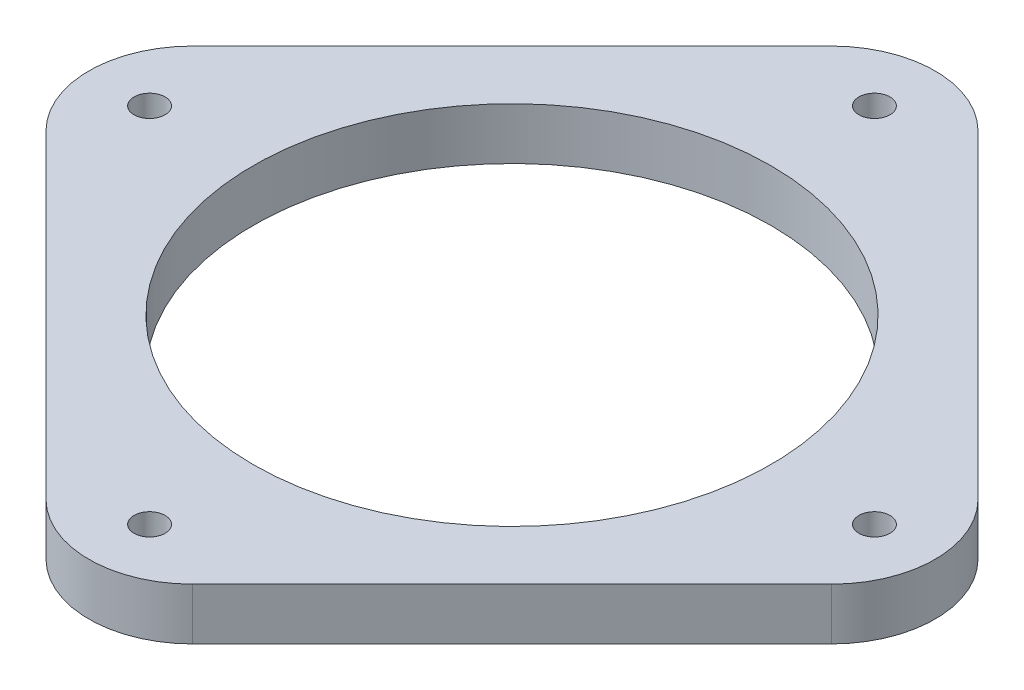
ISO-10303-21;
HEADER;
FILE_DESCRIPTION(('STEP AP214'),'2;1');
FILE_NAME('part.step','',(''),(''),'','','');
FILE_SCHEMA(('AUTOMOTIVE_DESIGN { 1 0 10303 214 1 1 1 1 }'));
ENDSEC;
DATA;
#1=APPLICATION_CONTEXT('core data for automotive mechanical design processes');
#2=APPLICATION_PROTOCOL_DEFINITION('international standard','automotive_design',2000,#1);
#3=PRODUCT_CONTEXT('',#1,'mechanical');
#4=PRODUCT('Part','Part','',(#3));
#5=PRODUCT_RELATED_PRODUCT_CATEGORY('part','',(#4));
#6=PRODUCT_DEFINITION_FORMATION('','',#4);
#7=PRODUCT_DEFINITION_CONTEXT('part definition',#1,'design');
#8=PRODUCT_DEFINITION('design','',#6,#7);
#9=PRODUCT_DEFINITION_SHAPE('','',#8);
#10=(LENGTH_UNIT() NAMED_UNIT(*) SI_UNIT(.MILLI.,.METRE.));
#11=(NAMED_UNIT(*) PLANE_ANGLE_UNIT() SI_UNIT($,.RADIAN.));
#12=(NAMED_UNIT(*) SI_UNIT($,.STERADIAN.) SOLID_ANGLE_UNIT());
#13=UNCERTAINTY_MEASURE_WITH_UNIT(LENGTH_MEASURE(1.E-05),#10,'distance_accuracy_value','');
#14=(GEOMETRIC_REPRESENTATION_CONTEXT(3) GLOBAL_UNCERTAINTY_ASSIGNED_CONTEXT((#13)) GLOBAL_UNIT_ASSIGNED_CONTEXT((#10,
#11,#12)) REPRESENTATION_CONTEXT('',''));
#15=CARTESIAN_POINT('',(0.,0.,0.));
#16=DIRECTION('',(0.,0.,1.));
#17=DIRECTION('',(1.,0.,0.));
#18=AXIS2_PLACEMENT_3D('',#15,#16,#17);
#19=CARTESIAN_POINT('',(0.,5.,30.8578643762691));
#20=DIRECTION('',(0.,1.,0.));
#21=DIRECTION('',(0.,0.,1.));
#22=AXIS2_PLACEMENT_3D('',#19,#20,#21);
#23=PLANE('',#22);
#24=CARTESIAN_POINT('',(-35.,5.,-2.44403693719019E-13));
#25=DIRECTION('',(0.,1.,0.));
#26=DIRECTION('',(0.,0.,1.));
#27=AXIS2_PLACEMENT_3D('',#24,#25,#26);
#28=CIRCLE('',#27,1.5);
#29=CARTESIAN_POINT('',(-35.,5.,1.49999999999976));
#30=VERTEX_POINT('',#29);
#31=EDGE_CURVE('E200',#30,#30,#28,.T.);
#32=ORIENTED_EDGE('',*,*,#31,.F.);
#33=EDGE_LOOP('',(#32));
#34=FACE_BOUND('',#33,.T.);
#35=CARTESIAN_POINT('',(35.,5.,0.));
#36=DIRECTION('',(0.,1.,0.));
#37=DIRECTION('',(0.,0.,1.));
#38=AXIS2_PLACEMENT_3D('',#35,#36,#37);
#39=CIRCLE('',#38,1.5);
#40=CARTESIAN_POINT('',(35.,5.,1.5));
#41=VERTEX_POINT('',#40);
#42=EDGE_CURVE('E188',#41,#41,#39,.T.);
#43=ORIENTED_EDGE('',*,*,#42,.F.);
#44=EDGE_LOOP('',(#43));
#45=FACE_BOUND('',#44,.T.);
#46=CARTESIAN_POINT('',(0.,5.,30.8578643762691));
#47=DIRECTION('',(0.,1.,0.));
#48=DIRECTION('',(0.,0.,1.));
#49=AXIS2_PLACEMENT_3D('',#46,#47,#48);
#50=CIRCLE('',#49,10.);
#51=CARTESIAN_POINT('',(-7.07106781186553,5.,37.9289321881345));
#52=VERTEX_POINT('',#51);
#53=CARTESIAN_POINT('',(7.07106781186552,5.,37.9289321881345));
#54=VERTEX_POINT('',#53);
#55=EDGE_CURVE('E151',#52,#54,#50,.T.);
#56=ORIENTED_EDGE('',*,*,#55,.T.);
#57=DIRECTION('',(0.707106781186548,0.,-0.707106781186547));
#58=VECTOR('',#57,1.);
#59=CARTESIAN_POINT('',(7.07106781186552,5.,37.9289321881345));
#60=LINE('',#59,#58);
#61=CARTESIAN_POINT('',(37.9289321881345,5.,7.07106781186553));
#62=VERTEX_POINT('',#61);
#63=EDGE_CURVE('E99',#54,#62,#60,.T.);
#64=ORIENTED_EDGE('',*,*,#63,.T.);
#65=CARTESIAN_POINT('',(30.8578643762691,5.,0.));
#66=DIRECTION('',(0.,1.,0.));
#67=DIRECTION('',(0.,0.,1.));
#68=AXIS2_PLACEMENT_3D('',#65,#66,#67);
#69=CIRCLE('',#68,10.);
#70=CARTESIAN_POINT('',(37.9289321881345,5.,-7.07106781186553));
#71=VERTEX_POINT('',#70);
#72=EDGE_CURVE('E166',#62,#71,#69,.T.);
#73=ORIENTED_EDGE('',*,*,#72,.T.);
#74=DIRECTION('',(-0.707106781186548,0.,-0.707106781186548));
#75=VECTOR('',#74,1.);
#76=CARTESIAN_POINT('',(37.9289321881345,5.,-7.07106781186553));
#77=LINE('',#76,#75);
#78=CARTESIAN_POINT('',(7.07106781186552,5.,-37.9289321881345));
#79=VERTEX_POINT('',#78);
#80=EDGE_CURVE('E179',#71,#79,#77,.T.);
#81=ORIENTED_EDGE('',*,*,#80,.T.);
#82=CARTESIAN_POINT('',(0.,5.,-30.8578643762691));
#83=DIRECTION('',(0.,1.,0.));
#84=DIRECTION('',(0.,0.,1.));
#85=AXIS2_PLACEMENT_3D('',#82,#83,#84);
#86=CIRCLE('',#85,10.);
#87=CARTESIAN_POINT('',(-7.07106781186553,5.,-37.9289321881345));
#88=VERTEX_POINT('',#87);
#89=EDGE_CURVE('E118',#79,#88,#86,.T.);
#90=ORIENTED_EDGE('',*,*,#89,.T.);
#91=DIRECTION('',(-0.707106781186547,0.,0.707106781186548));
#92=VECTOR('',#91,1.);
#93=CARTESIAN_POINT('',(-7.07106781186553,5.,-37.9289321881345));
#94=LINE('',#93,#92);
#95=CARTESIAN_POINT('',(-37.9289321881345,5.,-7.07106781186552));
#96=VERTEX_POINT('',#95);
#97=EDGE_CURVE('E112',#88,#96,#94,.T.);
#98=ORIENTED_EDGE('',*,*,#97,.T.);
#99=CARTESIAN_POINT('',(-30.857864376269,5.,0.));
#100=DIRECTION('',(0.,1.,0.));
#101=DIRECTION('',(0.,0.,-1.));
#102=AXIS2_PLACEMENT_3D('',#99,#100,#101);
#103=CIRCLE('',#102,10.);
#104=CARTESIAN_POINT('',(-37.9289321881345,5.,7.07106781186553));
#105=VERTEX_POINT('',#104);
#106=EDGE_CURVE('E116',#96,#105,#103,.T.);
#107=ORIENTED_EDGE('',*,*,#106,.T.);
#108=DIRECTION('',(0.707106781186547,0.,0.707106781186548));
#109=VECTOR('',#108,1.);
#110=CARTESIAN_POINT('',(-37.9289321881345,5.,7.07106781186553));
#111=LINE('',#110,#109);
#112=EDGE_CURVE('E56',#105,#52,#111,.T.);
#113=ORIENTED_EDGE('',*,*,#112,.T.);
#114=EDGE_LOOP('',(#56,#64,#73,#81,#90,#98,#107,#113));
#115=FACE_BOUND('',#114,.T.);
#116=CARTESIAN_POINT('',(0.,5.,0.));
#117=DIRECTION('',(0.,1.,0.));
#118=DIRECTION('',(0.,0.,1.));
#119=AXIS2_PLACEMENT_3D('',#116,#117,#118);
#120=CIRCLE('',#119,25.);
#121=CARTESIAN_POINT('',(0.,5.,25.));
#122=VERTEX_POINT('',#121);
#123=EDGE_CURVE('E140',#122,#122,#120,.T.);
#124=ORIENTED_EDGE('',*,*,#123,.F.);
#125=EDGE_LOOP('',(#124));
#126=FACE_BOUND('',#125,.T.);
#127=CARTESIAN_POINT('',(-1.2220184685951E-13,5.,35.));
#128=DIRECTION('',(0.,1.,0.));
#129=DIRECTION('',(0.,0.,1.));
#130=AXIS2_PLACEMENT_3D('',#127,#128,#129);
#131=CIRCLE('',#130,1.5);
#132=CARTESIAN_POINT('',(-1.2220184685951E-13,5.,36.5));
#133=VERTEX_POINT('',#132);
#134=EDGE_CURVE('E194',#133,#133,#131,.T.);
#135=ORIENTED_EDGE('',*,*,#134,.F.);
#136=EDGE_LOOP('',(#135));
#137=FACE_BOUND('',#136,.T.);
#138=CARTESIAN_POINT('',(3.66605540578529E-13,5.,-35.));
#139=DIRECTION('',(0.,1.,0.));
#140=DIRECTION('',(0.,0.,1.));
#141=AXIS2_PLACEMENT_3D('',#138,#139,#140);
#142=CIRCLE('',#141,1.50000000000001);
#143=CARTESIAN_POINT('',(3.66605540578529E-13,5.,-33.5));
#144=VERTEX_POINT('',#143);
#145=EDGE_CURVE('E206',#144,#144,#142,.T.);
#146=ORIENTED_EDGE('',*,*,#145,.F.);
#147=EDGE_LOOP('',(#146));
#148=FACE_BOUND('',#147,.T.);
#149=ADVANCED_FACE('F39',(#34,#45,#115,#126,#137,#148),#23,.T.);
#150=CARTESIAN_POINT('',(0.,0.,30.8578643762691));
#151=DIRECTION('',(0.,1.,0.));
#152=DIRECTION('',(0.,0.,1.));
#153=AXIS2_PLACEMENT_3D('',#150,#151,#152);
#154=PLANE('',#153);
#155=CARTESIAN_POINT('',(0.,0.,30.8578643762691));
#156=DIRECTION('',(0.,1.,0.));
#157=DIRECTION('',(0.,0.,1.));
#158=AXIS2_PLACEMENT_3D('',#155,#156,#157);
#159=CIRCLE('',#158,10.);
#160=CARTESIAN_POINT('',(-7.07106781186553,0.,37.9289321881345));
#161=VERTEX_POINT('',#160);
#162=CARTESIAN_POINT('',(7.07106781186552,0.,37.9289321881345));
#163=VERTEX_POINT('',#162);
#164=EDGE_CURVE('E136',#161,#163,#159,.T.);
#165=ORIENTED_EDGE('',*,*,#164,.F.);
#166=DIRECTION('',(0.707106781186547,0.,0.707106781186548));
#167=VECTOR('',#166,1.);
#168=CARTESIAN_POINT('',(-37.9289321881345,0.,7.07106781186553));
#169=LINE('',#168,#167);
#170=CARTESIAN_POINT('',(-37.9289321881345,0.,7.07106781186553));
#171=VERTEX_POINT('',#170);
#172=EDGE_CURVE('E91',#171,#161,#169,.T.);
#173=ORIENTED_EDGE('',*,*,#172,.F.);
#174=CARTESIAN_POINT('',(-30.857864376269,0.,0.));
#175=DIRECTION('',(0.,1.,0.));
#176=DIRECTION('',(0.,0.,-1.));
#177=AXIS2_PLACEMENT_3D('',#174,#175,#176);
#178=CIRCLE('',#177,10.);
#179=CARTESIAN_POINT('',(-37.9289321881345,0.,-7.07106781186552));
#180=VERTEX_POINT('',#179);
#181=EDGE_CURVE('E85',#180,#171,#178,.T.);
#182=ORIENTED_EDGE('',*,*,#181,.F.);
#183=DIRECTION('',(-0.707106781186547,0.,0.707106781186548));
#184=VECTOR('',#183,1.);
#185=CARTESIAN_POINT('',(-7.07106781186553,0.,-37.9289321881345));
#186=LINE('',#185,#184);
#187=CARTESIAN_POINT('',(-7.07106781186553,0.,-37.9289321881345));
#188=VERTEX_POINT('',#187);
#189=EDGE_CURVE('E126',#188,#180,#186,.T.);
#190=ORIENTED_EDGE('',*,*,#189,.F.);
#191=CARTESIAN_POINT('',(0.,0.,-30.8578643762691));
#192=DIRECTION('',(0.,1.,0.));
#193=DIRECTION('',(0.,0.,1.));
#194=AXIS2_PLACEMENT_3D('',#191,#192,#193);
#195=CIRCLE('',#194,10.);
#196=CARTESIAN_POINT('',(7.07106781186552,0.,-37.9289321881345));
#197=VERTEX_POINT('',#196);
#198=EDGE_CURVE('E146',#197,#188,#195,.T.);
#199=ORIENTED_EDGE('',*,*,#198,.F.);
#200=DIRECTION('',(-0.707106781186548,0.,-0.707106781186548));
#201=VECTOR('',#200,1.);
#202=CARTESIAN_POINT('',(37.9289321881345,0.,-7.07106781186553));
#203=LINE('',#202,#201);
#204=CARTESIAN_POINT('',(37.9289321881345,0.,-7.07106781186553));
#205=VERTEX_POINT('',#204);
#206=EDGE_CURVE('E144',#205,#197,#203,.T.);
#207=ORIENTED_EDGE('',*,*,#206,.F.);
#208=CARTESIAN_POINT('',(30.8578643762691,0.,0.));
#209=DIRECTION('',(0.,1.,0.));
#210=DIRECTION('',(0.,0.,1.));
#211=AXIS2_PLACEMENT_3D('',#208,#209,#210);
#212=CIRCLE('',#211,10.);
#213=CARTESIAN_POINT('',(37.9289321881345,0.,7.07106781186553));
#214=VERTEX_POINT('',#213);
#215=EDGE_CURVE('E142',#214,#205,#212,.T.);
#216=ORIENTED_EDGE('',*,*,#215,.F.);
#217=DIRECTION('',(0.707106781186548,0.,-0.707106781186547));
#218=VECTOR('',#217,1.);
#219=CARTESIAN_POINT('',(7.07106781186552,0.,37.9289321881345));
#220=LINE('',#219,#218);
#221=EDGE_CURVE('E139',#163,#214,#220,.T.);
#222=ORIENTED_EDGE('',*,*,#221,.F.);
#223=EDGE_LOOP('',(#165,#173,#182,#190,#199,#207,#216,#222));
#224=FACE_BOUND('',#223,.T.);
#225=CARTESIAN_POINT('',(0.,0.,0.));
#226=DIRECTION('',(0.,1.,0.));
#227=DIRECTION('',(0.,0.,1.));
#228=AXIS2_PLACEMENT_3D('',#225,#226,#227);
#229=CIRCLE('',#228,25.);
#230=CARTESIAN_POINT('',(0.,0.,25.));
#231=VERTEX_POINT('',#230);
#232=EDGE_CURVE('E185',#231,#231,#229,.T.);
#233=ORIENTED_EDGE('',*,*,#232,.T.);
#234=EDGE_LOOP('',(#233));
#235=FACE_BOUND('',#234,.T.);
#236=CARTESIAN_POINT('',(35.,0.,0.));
#237=DIRECTION('',(0.,1.,0.));
#238=DIRECTION('',(0.,0.,1.));
#239=AXIS2_PLACEMENT_3D('',#236,#237,#238);
#240=CIRCLE('',#239,1.5);
#241=CARTESIAN_POINT('',(35.,0.,1.5));
#242=VERTEX_POINT('',#241);
#243=EDGE_CURVE('E191',#242,#242,#240,.T.);
#244=ORIENTED_EDGE('',*,*,#243,.T.);
#245=EDGE_LOOP('',(#244));
#246=FACE_BOUND('',#245,.T.);
#247=CARTESIAN_POINT('',(-1.2220184685951E-13,0.,35.));
#248=DIRECTION('',(0.,1.,0.));
#249=DIRECTION('',(0.,0.,1.));
#250=AXIS2_PLACEMENT_3D('',#247,#248,#249);
#251=CIRCLE('',#250,1.5);
#252=CARTESIAN_POINT('',(-1.2220184685951E-13,0.,36.5));
#253=VERTEX_POINT('',#252);
#254=EDGE_CURVE('E197',#253,#253,#251,.T.);
#255=ORIENTED_EDGE('',*,*,#254,.T.);
#256=EDGE_LOOP('',(#255));
#257=FACE_BOUND('',#256,.T.);
#258=CARTESIAN_POINT('',(-35.,0.,-2.44403693719019E-13));
#259=DIRECTION('',(0.,1.,0.));
#260=DIRECTION('',(0.,0.,1.));
#261=AXIS2_PLACEMENT_3D('',#258,#259,#260);
#262=CIRCLE('',#261,1.5);
#263=CARTESIAN_POINT('',(-35.,0.,1.49999999999976));
#264=VERTEX_POINT('',#263);
#265=EDGE_CURVE('E203',#264,#264,#262,.T.);
#266=ORIENTED_EDGE('',*,*,#265,.T.);
#267=EDGE_LOOP('',(#266));
#268=FACE_BOUND('',#267,.T.);
#269=CARTESIAN_POINT('',(3.66605540578529E-13,0.,-35.));
#270=DIRECTION('',(0.,1.,0.));
#271=DIRECTION('',(0.,0.,1.));
#272=AXIS2_PLACEMENT_3D('',#269,#270,#271);
#273=CIRCLE('',#272,1.50000000000001);
#274=CARTESIAN_POINT('',(3.66605540578529E-13,0.,-33.5));
#275=VERTEX_POINT('',#274);
#276=EDGE_CURVE('E209',#275,#275,#273,.T.);
#277=ORIENTED_EDGE('',*,*,#276,.T.);
#278=EDGE_LOOP('',(#277));
#279=FACE_BOUND('',#278,.T.);
#280=ADVANCED_FACE('F170',(#224,#235,#246,#257,#268,#279),#154,.F.);
#281=CARTESIAN_POINT('',(0.,5.,30.8578643762691));
#282=DIRECTION('',(0.,-1.,0.));
#283=DIRECTION('',(0.,0.,-1.));
#284=AXIS2_PLACEMENT_3D('',#281,#282,#283);
#285=CYLINDRICAL_SURFACE('',#284,10.);
#286=ORIENTED_EDGE('',*,*,#164,.T.);
#287=DIRECTION('',(0.,-1.,0.));
#288=VECTOR('',#287,1.);
#289=CARTESIAN_POINT('',(7.07106781186552,5.,37.9289321881345));
#290=LINE('',#289,#288);
#291=EDGE_CURVE('E11',#54,#163,#290,.T.);
#292=ORIENTED_EDGE('',*,*,#291,.F.);
#293=ORIENTED_EDGE('',*,*,#55,.F.);
#294=DIRECTION('',(0.,-1.,0.));
#295=VECTOR('',#294,1.);
#296=CARTESIAN_POINT('',(-7.07106781186553,5.,37.9289321881345));
#297=LINE('',#296,#295);
#298=EDGE_CURVE('E132',#52,#161,#297,.T.);
#299=ORIENTED_EDGE('',*,*,#298,.T.);
#300=EDGE_LOOP('',(#286,#292,#293,#299));
#301=FACE_BOUND('',#300,.T.);
#302=ADVANCED_FACE('F41',(#301),#285,.T.);
#303=CARTESIAN_POINT('',(7.07106781186552,5.,37.9289321881345));
#304=DIRECTION('',(-0.707106781186547,0.,-0.707106781186548));
#305=DIRECTION('',(-0.707106781186548,0.,0.707106781186547));
#306=AXIS2_PLACEMENT_3D('',#303,#304,#305);
#307=PLANE('',#306);
#308=ORIENTED_EDGE('',*,*,#221,.T.);
#309=DIRECTION('',(0.,-1.,0.));
#310=VECTOR('',#309,1.);
#311=CARTESIAN_POINT('',(37.9289321881345,5.,7.07106781186553));
#312=LINE('',#311,#310);
#313=EDGE_CURVE('E48',#62,#214,#312,.T.);
#314=ORIENTED_EDGE('',*,*,#313,.F.);
#315=ORIENTED_EDGE('',*,*,#63,.F.);
#316=ORIENTED_EDGE('',*,*,#291,.T.);
#317=EDGE_LOOP('',(#308,#314,#315,#316));
#318=FACE_BOUND('',#317,.T.);
#319=ADVANCED_FACE('F243',(#318),#307,.F.);
#320=CARTESIAN_POINT('',(30.8578643762691,5.,0.));
#321=DIRECTION('',(0.,-1.,0.));
#322=DIRECTION('',(0.,0.,-1.));
#323=AXIS2_PLACEMENT_3D('',#320,#321,#322);
#324=CYLINDRICAL_SURFACE('',#323,10.);
#325=ORIENTED_EDGE('',*,*,#215,.T.);
#326=DIRECTION('',(0.,-1.,0.));
#327=VECTOR('',#326,1.);
#328=CARTESIAN_POINT('',(37.9289321881345,5.,-7.07106781186553));
#329=LINE('',#328,#327);
#330=EDGE_CURVE('E158',#71,#205,#329,.T.);
#331=ORIENTED_EDGE('',*,*,#330,.F.);
#332=ORIENTED_EDGE('',*,*,#72,.F.);
#333=ORIENTED_EDGE('',*,*,#313,.T.);
#334=EDGE_LOOP('',(#325,#331,#332,#333));
#335=FACE_BOUND('',#334,.T.);
#336=ADVANCED_FACE('F164',(#335),#324,.T.);
#337=CARTESIAN_POINT('',(37.9289321881345,5.,-7.07106781186553));
#338=DIRECTION('',(-0.707106781186548,0.,0.707106781186548));
#339=DIRECTION('',(0.707106781186548,0.,0.707106781186548));
#340=AXIS2_PLACEMENT_3D('',#337,#338,#339);
#341=PLANE('',#340);
#342=ORIENTED_EDGE('',*,*,#206,.T.);
#343=DIRECTION('',(0.,-1.,0.));
#344=VECTOR('',#343,1.);
#345=CARTESIAN_POINT('',(7.07106781186552,5.,-37.9289321881345));
#346=LINE('',#345,#344);
#347=EDGE_CURVE('E155',#79,#197,#346,.T.);
#348=ORIENTED_EDGE('',*,*,#347,.F.);
#349=ORIENTED_EDGE('',*,*,#80,.F.);
#350=ORIENTED_EDGE('',*,*,#330,.T.);
#351=EDGE_LOOP('',(#342,#348,#349,#350));
#352=FACE_BOUND('',#351,.T.);
#353=ADVANCED_FACE('F175',(#352),#341,.F.);
#354=CARTESIAN_POINT('',(0.,5.,-30.8578643762691));
#355=DIRECTION('',(0.,-1.,0.));
#356=DIRECTION('',(0.,0.,-1.));
#357=AXIS2_PLACEMENT_3D('',#354,#355,#356);
#358=CYLINDRICAL_SURFACE('',#357,10.);
#359=ORIENTED_EDGE('',*,*,#198,.T.);
#360=DIRECTION('',(0.,-1.,0.));
#361=VECTOR('',#360,1.);
#362=CARTESIAN_POINT('',(-7.07106781186553,5.,-37.9289321881345));
#363=LINE('',#362,#361);
#364=EDGE_CURVE('E127',#88,#188,#363,.T.);
#365=ORIENTED_EDGE('',*,*,#364,.F.);
#366=ORIENTED_EDGE('',*,*,#89,.F.);
#367=ORIENTED_EDGE('',*,*,#347,.T.);
#368=EDGE_LOOP('',(#359,#365,#366,#367));
#369=FACE_BOUND('',#368,.T.);
#370=ADVANCED_FACE('F178',(#369),#358,.T.);
#371=CARTESIAN_POINT('',(-7.07106781186553,5.,-37.9289321881345));
#372=DIRECTION('',(0.707106781186548,0.,0.707106781186547));
#373=DIRECTION('',(0.707106781186547,0.,-0.707106781186548));
#374=AXIS2_PLACEMENT_3D('',#371,#372,#373);
#375=PLANE('',#374);
#376=ORIENTED_EDGE('',*,*,#189,.T.);
#377=DIRECTION('',(0.,-1.,0.));
#378=VECTOR('',#377,1.);
#379=CARTESIAN_POINT('',(-37.9289321881345,5.,-7.07106781186552));
#380=LINE('',#379,#378);
#381=EDGE_CURVE('E123',#96,#180,#380,.T.);
#382=ORIENTED_EDGE('',*,*,#381,.F.);
#383=ORIENTED_EDGE('',*,*,#97,.F.);
#384=ORIENTED_EDGE('',*,*,#364,.T.);
#385=EDGE_LOOP('',(#376,#382,#383,#384));
#386=FACE_BOUND('',#385,.T.);
#387=ADVANCED_FACE('F124',(#386),#375,.F.);
#388=CARTESIAN_POINT('',(-30.857864376269,5.,0.));
#389=DIRECTION('',(0.,-1.,0.));
#390=DIRECTION('',(0.,0.,-1.));
#391=AXIS2_PLACEMENT_3D('',#388,#389,#390);
#392=CYLINDRICAL_SURFACE('',#391,10.);
#393=ORIENTED_EDGE('',*,*,#181,.T.);
#394=DIRECTION('',(0.,-1.,0.));
#395=VECTOR('',#394,1.);
#396=CARTESIAN_POINT('',(-37.9289321881345,5.,7.07106781186553));
#397=LINE('',#396,#395);
#398=EDGE_CURVE('E128',#105,#171,#397,.T.);
#399=ORIENTED_EDGE('',*,*,#398,.F.);
#400=ORIENTED_EDGE('',*,*,#106,.F.);
#401=ORIENTED_EDGE('',*,*,#381,.T.);
#402=EDGE_LOOP('',(#393,#399,#400,#401));
#403=FACE_BOUND('',#402,.T.);
#404=ADVANCED_FACE('F130',(#403),#392,.T.);
#405=CARTESIAN_POINT('',(-37.9289321881345,5.,7.07106781186553));
#406=DIRECTION('',(0.707106781186548,0.,-0.707106781186547));
#407=DIRECTION('',(-0.707106781186547,0.,-0.707106781186548));
#408=AXIS2_PLACEMENT_3D('',#405,#406,#407);
#409=PLANE('',#408);
#410=ORIENTED_EDGE('',*,*,#172,.T.);
#411=ORIENTED_EDGE('',*,*,#298,.F.);
#412=ORIENTED_EDGE('',*,*,#112,.F.);
#413=ORIENTED_EDGE('',*,*,#398,.T.);
#414=EDGE_LOOP('',(#410,#411,#412,#413));
#415=FACE_BOUND('',#414,.T.);
#416=ADVANCED_FACE('F231',(#415),#409,.F.);
#417=CARTESIAN_POINT('',(0.,5.,0.));
#418=DIRECTION('',(0.,-1.,0.));
#419=DIRECTION('',(0.,0.,-1.));
#420=AXIS2_PLACEMENT_3D('',#417,#418,#419);
#421=CYLINDRICAL_SURFACE('',#420,25.);
#422=ORIENTED_EDGE('',*,*,#123,.T.);
#423=EDGE_LOOP('',(#422));
#424=FACE_BOUND('',#423,.T.);
#425=ORIENTED_EDGE('',*,*,#232,.F.);
#426=EDGE_LOOP('',(#425));
#427=FACE_BOUND('',#426,.T.);
#428=ADVANCED_FACE('F228',(#424,#427),#421,.F.);
#429=CARTESIAN_POINT('',(35.,5.,0.));
#430=DIRECTION('',(0.,-1.,0.));
#431=DIRECTION('',(0.,0.,-1.));
#432=AXIS2_PLACEMENT_3D('',#429,#430,#431);
#433=CYLINDRICAL_SURFACE('',#432,1.5);
#434=ORIENTED_EDGE('',*,*,#42,.T.);
#435=EDGE_LOOP('',(#434));
#436=FACE_BOUND('',#435,.T.);
#437=ORIENTED_EDGE('',*,*,#243,.F.);
#438=EDGE_LOOP('',(#437));
#439=FACE_BOUND('',#438,.T.);
#440=ADVANCED_FACE('F306',(#436,#439),#433,.F.);
#441=CARTESIAN_POINT('',(-1.2220184685951E-13,5.,35.));
#442=DIRECTION('',(0.,-1.,0.));
#443=DIRECTION('',(0.,0.,-1.));
#444=AXIS2_PLACEMENT_3D('',#441,#442,#443);
#445=CYLINDRICAL_SURFACE('',#444,1.5);
#446=ORIENTED_EDGE('',*,*,#134,.T.);
#447=EDGE_LOOP('',(#446));
#448=FACE_BOUND('',#447,.T.);
#449=ORIENTED_EDGE('',*,*,#254,.F.);
#450=EDGE_LOOP('',(#449));
#451=FACE_BOUND('',#450,.T.);
#452=ADVANCED_FACE('F314',(#448,#451),#445,.F.);
#453=CARTESIAN_POINT('',(-35.,5.,-2.44403693719019E-13));
#454=DIRECTION('',(0.,-1.,0.));
#455=DIRECTION('',(0.,0.,-1.));
#456=AXIS2_PLACEMENT_3D('',#453,#454,#455);
#457=CYLINDRICAL_SURFACE('',#456,1.5);
#458=ORIENTED_EDGE('',*,*,#31,.T.);
#459=EDGE_LOOP('',(#458));
#460=FACE_BOUND('',#459,.T.);
#461=ORIENTED_EDGE('',*,*,#265,.F.);
#462=EDGE_LOOP('',(#461));
#463=FACE_BOUND('',#462,.T.);
#464=ADVANCED_FACE('F322',(#460,#463),#457,.F.);
#465=CARTESIAN_POINT('',(3.66605540578529E-13,5.,-35.));
#466=DIRECTION('',(0.,-1.,0.));
#467=DIRECTION('',(0.,0.,-1.));
#468=AXIS2_PLACEMENT_3D('',#465,#466,#467);
#469=CYLINDRICAL_SURFACE('',#468,1.50000000000001);
#470=ORIENTED_EDGE('',*,*,#145,.T.);
#471=EDGE_LOOP('',(#470));
#472=FACE_BOUND('',#471,.T.);
#473=ORIENTED_EDGE('',*,*,#276,.F.);
#474=EDGE_LOOP('',(#473));
#475=FACE_BOUND('',#474,.T.);
#476=ADVANCED_FACE('F215',(#472,#475),#469,.F.);
#477=CLOSED_SHELL('',(#149,#280,#302,#319,#336,#353,#370,#387,#404,#416,#428,#440,#452,#464,#476));
#478=MANIFOLD_SOLID_BREP('B2',#477);
#479=ADVANCED_BREP_SHAPE_REPRESENTATION('',(#18,#478),#14);
#480=SHAPE_DEFINITION_REPRESENTATION(#9,#479);
ENDSEC;
END-ISO-10303-21;
